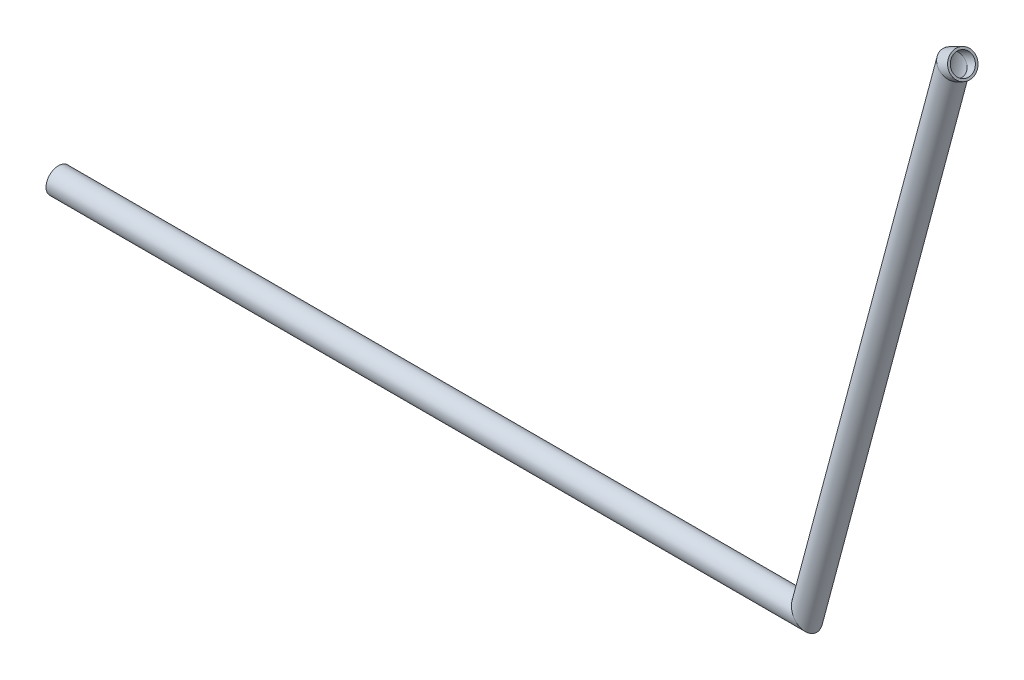
ISO-10303-21;
HEADER;
FILE_DESCRIPTION(('STEP AP214'),'2;1');
FILE_NAME('part.step','',(''),(''),'','','');
FILE_SCHEMA(('AUTOMOTIVE_DESIGN { 1 0 10303 214 1 1 1 1 }'));
ENDSEC;
DATA;
#1=APPLICATION_CONTEXT('core data for automotive mechanical design processes');
#2=APPLICATION_PROTOCOL_DEFINITION('international standard','automotive_design',2000,#1);
#3=PRODUCT_CONTEXT('',#1,'mechanical');
#4=PRODUCT('Part','Part','',(#3));
#5=PRODUCT_RELATED_PRODUCT_CATEGORY('part','',(#4));
#6=PRODUCT_DEFINITION_FORMATION('','',#4);
#7=PRODUCT_DEFINITION_CONTEXT('part definition',#1,'design');
#8=PRODUCT_DEFINITION('design','',#6,#7);
#9=PRODUCT_DEFINITION_SHAPE('','',#8);
#10=(LENGTH_UNIT() NAMED_UNIT(*) SI_UNIT(.MILLI.,.METRE.));
#11=(NAMED_UNIT(*) PLANE_ANGLE_UNIT() SI_UNIT($,.RADIAN.));
#12=(NAMED_UNIT(*) SI_UNIT($,.STERADIAN.) SOLID_ANGLE_UNIT());
#13=UNCERTAINTY_MEASURE_WITH_UNIT(LENGTH_MEASURE(1.E-05),#10,'distance_accuracy_value','');
#14=(GEOMETRIC_REPRESENTATION_CONTEXT(3) GLOBAL_UNCERTAINTY_ASSIGNED_CONTEXT((#13)) GLOBAL_UNIT_ASSIGNED_CONTEXT((#10,
#11,#12)) REPRESENTATION_CONTEXT('',''));
#15=CARTESIAN_POINT('',(0.,0.,0.));
#16=DIRECTION('',(0.,0.,1.));
#17=DIRECTION('',(1.,0.,0.));
#18=AXIS2_PLACEMENT_3D('',#15,#16,#17);
#19=CARTESIAN_POINT('',(707.145120390001,360.208639042842,99.6481236966863));
#20=DIRECTION('',(0.853148239039184,0.50523853709746,0.129892658976393));
#21=DIRECTION('',(-0.509555459509443,0.860437815117467,0.));
#22=AXIS2_PLACEMENT_3D('',#19,#20,#21);
#23=CYLINDRICAL_SURFACE('',#22,7.874);
#24=CARTESIAN_POINT('',(715.676602780393,365.261024413817,100.94705028645));
#25=DIRECTION('',(-0.853148239039184,-0.50523853709746,-0.129892658976393));
#26=DIRECTION('',(-0.0844819600368261,-0.111895626628857,0.990122299097274));
#27=AXIS2_PLACEMENT_3D('',#24,#25,#26);
#28=CIRCLE('',#27,7.874);
#29=CARTESIAN_POINT('',(715.011391827063,364.379958249741,108.743273269542));
#30=VERTEX_POINT('',#29);
#31=EDGE_CURVE('E59',#30,#30,#28,.T.);
#32=ORIENTED_EDGE('',*,*,#31,.F.);
#33=EDGE_LOOP('',(#32));
#34=FACE_BOUND('',#33,.T.);
#35=CARTESIAN_POINT('',(707.145120390001,360.208639042842,99.6481236966863));
#36=DIRECTION('',(-0.601064457277323,-0.796104683911956,-0.0702769553364618));
#37=DIRECTION('',(0.779186181999029,-0.603297927882931,0.17000148232865));
#38=AXIS2_PLACEMENT_3D('',#35,#36,#37);
#39=ELLIPSE('',#38,8.5202774457003,7.874);
#40=CARTESIAN_POINT('',(713.784002842489,355.068373314864,101.096583492307));
#41=VERTEX_POINT('',#40);
#42=EDGE_CURVE('E55',#41,#41,#39,.T.);
#43=ORIENTED_EDGE('',*,*,#42,.T.);
#44=EDGE_LOOP('',(#43));
#45=FACE_BOUND('',#44,.T.);
#46=ADVANCED_FACE('F51',(#34,#45),#23,.F.);
#47=CARTESIAN_POINT('',(707.145120390001,360.208639042842,99.6481236966863));
#48=DIRECTION('',(0.853148239039184,0.50523853709746,0.129892658976393));
#49=DIRECTION('',(-0.509555459509443,0.860437815117467,0.));
#50=AXIS2_PLACEMENT_3D('',#47,#48,#49);
#51=CYLINDRICAL_SURFACE('',#50,9.52499999999999);
#52=CARTESIAN_POINT('',(715.676602780393,365.261024413817,100.94705028645));
#53=DIRECTION('',(-0.853148239039184,-0.50523853709746,-0.129892658976393));
#54=DIRECTION('',(-0.0844819600368261,-0.111895626628857,0.990122299097274));
#55=AXIS2_PLACEMENT_3D('',#52,#53,#54);
#56=CIRCLE('',#55,9.52499999999999);
#57=CARTESIAN_POINT('',(714.871912111042,364.195218570177,110.377965185352));
#58=VERTEX_POINT('',#57);
#59=EDGE_CURVE('E63',#58,#58,#56,.T.);
#60=ORIENTED_EDGE('',*,*,#59,.T.);
#61=EDGE_LOOP('',(#60));
#62=FACE_BOUND('',#61,.T.);
#63=CARTESIAN_POINT('',(707.145120390001,360.208639042842,99.6481236966863));
#64=DIRECTION('',(-0.601064457277323,-0.796104683911956,-0.0702769553364618));
#65=DIRECTION('',(0.779186181999029,-0.603297927882931,0.17000148232865));
#66=AXIS2_PLACEMENT_3D('',#63,#64,#65);
#67=ELLIPSE('',#66,10.306787232702,9.52499999999999);
#68=CARTESIAN_POINT('',(715.176026582526,353.990575662223,101.400292804292));
#69=VERTEX_POINT('',#68);
#70=EDGE_CURVE('E12',#69,#69,#67,.T.);
#71=ORIENTED_EDGE('',*,*,#70,.F.);
#72=EDGE_LOOP('',(#71));
#73=FACE_BOUND('',#72,.T.);
#74=ADVANCED_FACE('F78',(#62,#73),#51,.T.);
#75=CARTESIAN_POINT('',(715.676602780393,365.261024413817,100.94705028645));
#76=DIRECTION('',(-0.853148239039184,-0.50523853709746,-0.129892658976393));
#77=DIRECTION('',(-0.0844819600368261,-0.111895626628857,0.990122299097274));
#78=AXIS2_PLACEMENT_3D('',#75,#76,#77);
#79=PLANE('',#78);
#80=ORIENTED_EDGE('',*,*,#31,.T.);
#81=EDGE_LOOP('',(#80));
#82=FACE_BOUND('',#81,.T.);
#83=ORIENTED_EDGE('',*,*,#59,.F.);
#84=EDGE_LOOP('',(#83));
#85=FACE_BOUND('',#84,.T.);
#86=ADVANCED_FACE('F74',(#82,#85),#79,.F.);
#87=CARTESIAN_POINT('',(707.145120390001,360.208639042842,99.6481236966863));
#88=DIRECTION('',(-0.601064457277323,-0.796104683911956,-0.0702769553364618));
#89=DIRECTION('',(0.798077917043875,-0.602554261728278,0.));
#90=AXIS2_PLACEMENT_3D('',#87,#88,#89);
#91=PLANE('',#90);
#92=ORIENTED_EDGE('',*,*,#42,.F.);
#93=EDGE_LOOP('',(#92));
#94=FACE_BOUND('',#93,.T.);
#95=ORIENTED_EDGE('',*,*,#70,.T.);
#96=EDGE_LOOP('',(#95));
#97=FACE_BOUND('',#96,.T.);
#98=ADVANCED_FACE('F53',(#94,#97),#91,.T.);
#99=CLOSED_SHELL('',(#46,#74,#86,#98));
#100=MANIFOLD_SOLID_BREP('B2',#99);
#101=CARTESIAN_POINT('',(595.900000000001,-56.7274061923323,99.6481236966863));
#102=DIRECTION('',(0.257797165441747,0.966199058936719,0.));
#103=DIRECTION('',(-0.966199058936719,0.257797165441747,0.));
#104=AXIS2_PLACEMENT_3D('',#101,#102,#103);
#105=CYLINDRICAL_SURFACE('',#104,7.874);
#106=CARTESIAN_POINT('',(595.900000000001,-56.7274061923323,99.6481236966863));
#107=DIRECTION('',(-0.793031262133387,-0.609180939687977,0.));
#108=DIRECTION('',(-0.609180939687977,0.793031262133388,0.));
#109=AXIS2_PLACEMENT_3D('',#106,#107,#108);
#110=ELLIPSE('',#109,9.92899066654399,7.874);
#111=CARTESIAN_POINT('',(589.851448135603,-48.8534061923323,99.6481236966863));
#112=VERTEX_POINT('',#111);
#113=EDGE_CURVE('E164',#112,#112,#110,.T.);
#114=ORIENTED_EDGE('',*,*,#113,.T.);
#115=EDGE_LOOP('',(#114));
#116=FACE_BOUND('',#115,.T.);
#117=CARTESIAN_POINT('',(707.145120390001,360.208639042842,99.6481236966863));
#118=DIRECTION('',(0.601064457277323,0.796104683911956,0.0702769553364618));
#119=DIRECTION('',(-0.779186181999029,0.603297927882931,-0.17000148232865));
#120=AXIS2_PLACEMENT_3D('',#117,#118,#119);
#121=ELLIPSE('',#120,8.5202774457003,7.874);
#122=CARTESIAN_POINT('',(700.506237937513,365.348904770821,98.1996639010658));
#123=VERTEX_POINT('',#122);
#124=EDGE_CURVE('E154',#123,#123,#121,.T.);
#125=ORIENTED_EDGE('',*,*,#124,.T.);
#126=EDGE_LOOP('',(#125));
#127=FACE_BOUND('',#126,.T.);
#128=ADVANCED_FACE('F150',(#116,#127),#105,.F.);
#129=CARTESIAN_POINT('',(595.900000000001,-56.7274061923323,99.6481236966863));
#130=DIRECTION('',(0.257797165441747,0.966199058936719,0.));
#131=DIRECTION('',(-0.966199058936719,0.257797165441747,0.));
#132=AXIS2_PLACEMENT_3D('',#129,#130,#131);
#133=CYLINDRICAL_SURFACE('',#132,9.52499999999999);
#134=CARTESIAN_POINT('',(595.900000000001,-56.7274061923323,99.6481236966863));
#135=DIRECTION('',(-0.793031262133387,-0.609180939687977,0.));
#136=DIRECTION('',(-0.609180939687977,0.793031262133388,0.));
#137=AXIS2_PLACEMENT_3D('',#134,#135,#136);
#138=ELLIPSE('',#137,12.0108758063032,9.52499999999999);
#139=CARTESIAN_POINT('',(588.583203389842,-47.2024061923323,99.6481236966863));
#140=VERTEX_POINT('',#139);
#141=EDGE_CURVE('E158',#140,#140,#138,.T.);
#142=ORIENTED_EDGE('',*,*,#141,.F.);
#143=EDGE_LOOP('',(#142));
#144=FACE_BOUND('',#143,.T.);
#145=CARTESIAN_POINT('',(707.145120390001,360.208639042842,99.6481236966863));
#146=DIRECTION('',(0.601064457277323,0.796104683911956,0.0702769553364618));
#147=DIRECTION('',(-0.779186181999029,0.603297927882931,-0.17000148232865));
#148=AXIS2_PLACEMENT_3D('',#145,#146,#147);
#149=ELLIPSE('',#148,10.306787232702,9.52499999999999);
#150=CARTESIAN_POINT('',(699.114214197476,366.426702423462,97.8959545890809));
#151=VERTEX_POINT('',#150);
#152=EDGE_CURVE('E50',#151,#151,#149,.T.);
#153=ORIENTED_EDGE('',*,*,#152,.F.);
#154=EDGE_LOOP('',(#153));
#155=FACE_BOUND('',#154,.T.);
#156=ADVANCED_FACE('F177',(#144,#155),#133,.T.);
#157=CARTESIAN_POINT('',(595.900000000001,-56.7274061923324,99.6481236966863));
#158=DIRECTION('',(-0.793031262133387,-0.609180939687977,0.));
#159=DIRECTION('',(0.609180939687977,-0.793031262133388,0.));
#160=AXIS2_PLACEMENT_3D('',#157,#158,#159);
#161=PLANE('',#160);
#162=ORIENTED_EDGE('',*,*,#113,.F.);
#163=EDGE_LOOP('',(#162));
#164=FACE_BOUND('',#163,.T.);
#165=ORIENTED_EDGE('',*,*,#141,.T.);
#166=EDGE_LOOP('',(#165));
#167=FACE_BOUND('',#166,.T.);
#168=ADVANCED_FACE('F173',(#164,#167),#161,.T.);
#169=CARTESIAN_POINT('',(707.145120390001,360.208639042842,99.6481236966863));
#170=DIRECTION('',(0.601064457277323,0.796104683911956,0.0702769553364618));
#171=DIRECTION('',(-0.798077917043875,0.602554261728278,0.));
#172=AXIS2_PLACEMENT_3D('',#169,#170,#171);
#173=PLANE('',#172);
#174=ORIENTED_EDGE('',*,*,#124,.F.);
#175=EDGE_LOOP('',(#174));
#176=FACE_BOUND('',#175,.T.);
#177=ORIENTED_EDGE('',*,*,#152,.T.);
#178=EDGE_LOOP('',(#177));
#179=FACE_BOUND('',#178,.T.);
#180=ADVANCED_FACE('F152',(#176,#179),#173,.T.);
#181=CLOSED_SHELL('',(#128,#156,#168,#180));
#182=MANIFOLD_SOLID_BREP('B7',#181);
#183=CARTESIAN_POINT('',(25.900000000001,-56.7274061923324,99.6481236966863));
#184=DIRECTION('',(1.,0.,0.));
#185=DIRECTION('',(0.,0.,-1.));
#186=AXIS2_PLACEMENT_3D('',#183,#184,#185);
#187=CYLINDRICAL_SURFACE('',#186,7.874);
#188=CARTESIAN_POINT('',(25.900000000001,-56.7274061923324,99.6481236966863));
#189=DIRECTION('',(-1.,0.,0.));
#190=DIRECTION('',(0.,0.,1.));
#191=AXIS2_PLACEMENT_3D('',#188,#189,#190);
#192=CIRCLE('',#191,7.874);
#193=CARTESIAN_POINT('',(25.900000000001,-56.7274061923324,107.522123696686));
#194=VERTEX_POINT('',#193);
#195=EDGE_CURVE('E258',#194,#194,#192,.T.);
#196=ORIENTED_EDGE('',*,*,#195,.T.);
#197=EDGE_LOOP('',(#196));
#198=FACE_BOUND('',#197,.T.);
#199=CARTESIAN_POINT('',(595.900000000001,-56.7274061923324,99.6481236966863));
#200=DIRECTION('',(0.793031262133387,0.609180939687977,0.));
#201=DIRECTION('',(0.609180939687977,-0.793031262133387,0.));
#202=AXIS2_PLACEMENT_3D('',#199,#200,#201);
#203=ELLIPSE('',#202,9.92899066654399,7.874);
#204=CARTESIAN_POINT('',(601.9485518644,-64.6014061923324,99.6481236966863));
#205=VERTEX_POINT('',#204);
#206=EDGE_CURVE('E248',#205,#205,#203,.T.);
#207=ORIENTED_EDGE('',*,*,#206,.T.);
#208=EDGE_LOOP('',(#207));
#209=FACE_BOUND('',#208,.T.);
#210=ADVANCED_FACE('F244',(#198,#209),#187,.F.);
#211=CARTESIAN_POINT('',(25.900000000001,-56.7274061923324,99.6481236966863));
#212=DIRECTION('',(1.,0.,0.));
#213=DIRECTION('',(0.,0.,-1.));
#214=AXIS2_PLACEMENT_3D('',#211,#212,#213);
#215=CYLINDRICAL_SURFACE('',#214,9.52499999999999);
#216=CARTESIAN_POINT('',(25.900000000001,-56.7274061923324,99.6481236966863));
#217=DIRECTION('',(-1.,0.,0.));
#218=DIRECTION('',(0.,0.,1.));
#219=AXIS2_PLACEMENT_3D('',#216,#217,#218);
#220=CIRCLE('',#219,9.52499999999999);
#221=CARTESIAN_POINT('',(25.900000000001,-56.7274061923324,109.173123696686));
#222=VERTEX_POINT('',#221);
#223=EDGE_CURVE('E252',#222,#222,#220,.T.);
#224=ORIENTED_EDGE('',*,*,#223,.F.);
#225=EDGE_LOOP('',(#224));
#226=FACE_BOUND('',#225,.T.);
#227=CARTESIAN_POINT('',(595.900000000001,-56.7274061923324,99.6481236966863));
#228=DIRECTION('',(0.793031262133387,0.609180939687977,0.));
#229=DIRECTION('',(0.609180939687977,-0.793031262133387,0.));
#230=AXIS2_PLACEMENT_3D('',#227,#228,#229);
#231=ELLIPSE('',#230,12.0108758063032,9.52499999999999);
#232=CARTESIAN_POINT('',(603.21679661016,-66.2524061923323,99.6481236966863));
#233=VERTEX_POINT('',#232);
#234=EDGE_CURVE('E149',#233,#233,#231,.T.);
#235=ORIENTED_EDGE('',*,*,#234,.F.);
#236=EDGE_LOOP('',(#235));
#237=FACE_BOUND('',#236,.T.);
#238=ADVANCED_FACE('F271',(#226,#237),#215,.T.);
#239=CARTESIAN_POINT('',(25.900000000001,-56.7274061923324,99.6481236966863));
#240=DIRECTION('',(-1.,0.,0.));
#241=DIRECTION('',(0.,0.,1.));
#242=AXIS2_PLACEMENT_3D('',#239,#240,#241);
#243=PLANE('',#242);
#244=ORIENTED_EDGE('',*,*,#195,.F.);
#245=EDGE_LOOP('',(#244));
#246=FACE_BOUND('',#245,.T.);
#247=ORIENTED_EDGE('',*,*,#223,.T.);
#248=EDGE_LOOP('',(#247));
#249=FACE_BOUND('',#248,.T.);
#250=ADVANCED_FACE('F267',(#246,#249),#243,.T.);
#251=CARTESIAN_POINT('',(595.900000000001,-56.7274061923324,99.6481236966863));
#252=DIRECTION('',(0.793031262133387,0.609180939687977,0.));
#253=DIRECTION('',(-0.609180939687977,0.793031262133387,0.));
#254=AXIS2_PLACEMENT_3D('',#251,#252,#253);
#255=PLANE('',#254);
#256=ORIENTED_EDGE('',*,*,#206,.F.);
#257=EDGE_LOOP('',(#256));
#258=FACE_BOUND('',#257,.T.);
#259=ORIENTED_EDGE('',*,*,#234,.T.);
#260=EDGE_LOOP('',(#259));
#261=FACE_BOUND('',#260,.T.);
#262=ADVANCED_FACE('F246',(#258,#261),#255,.T.);
#263=CLOSED_SHELL('',(#210,#238,#250,#262));
#264=MANIFOLD_SOLID_BREP('B45',#263);
#265=ADVANCED_BREP_SHAPE_REPRESENTATION('',(#18,#100,#182,#264),#14);
#266=SHAPE_DEFINITION_REPRESENTATION(#9,#265);
ENDSEC;
END-ISO-10303-21;
